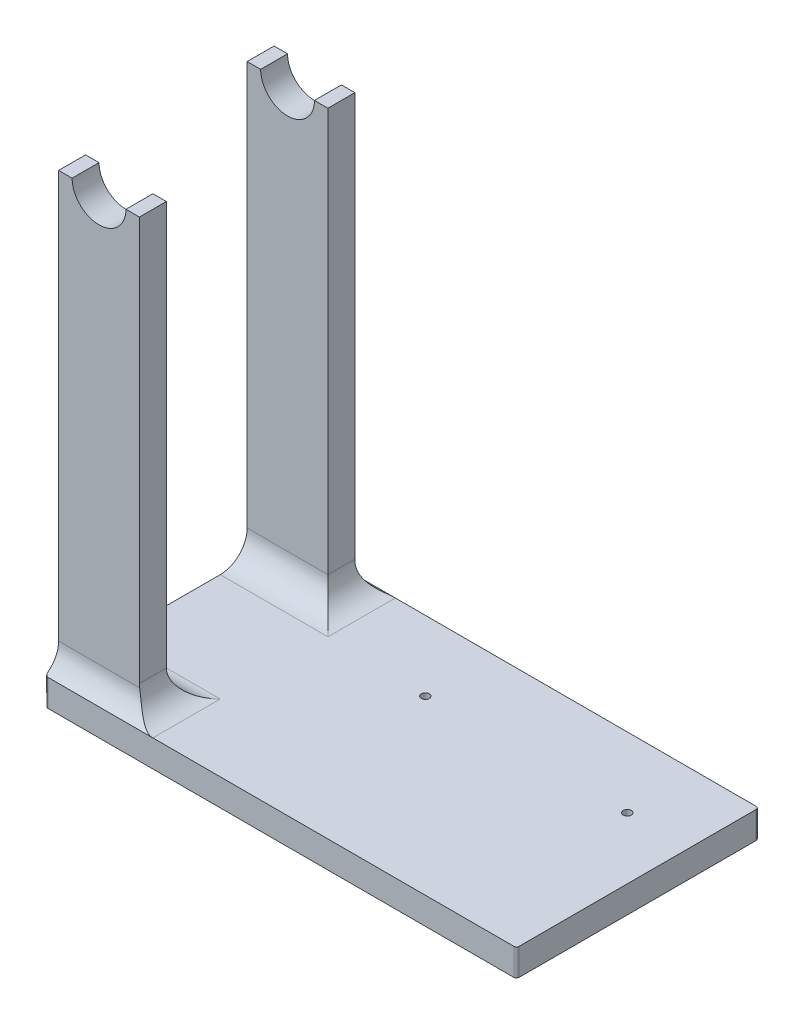
ISO-10303-21;
HEADER;
FILE_DESCRIPTION(('STEP AP214'),'2;1');
FILE_NAME('part.step','',(''),(''),'','','');
FILE_SCHEMA(('AUTOMOTIVE_DESIGN { 1 0 10303 214 1 1 1 1 }'));
ENDSEC;
DATA;
#1=APPLICATION_CONTEXT('core data for automotive mechanical design processes');
#2=APPLICATION_PROTOCOL_DEFINITION('international standard','automotive_design',2000,#1);
#3=PRODUCT_CONTEXT('',#1,'mechanical');
#4=PRODUCT('Part','Part','',(#3));
#5=PRODUCT_RELATED_PRODUCT_CATEGORY('part','',(#4));
#6=PRODUCT_DEFINITION_FORMATION('','',#4);
#7=PRODUCT_DEFINITION_CONTEXT('part definition',#1,'design');
#8=PRODUCT_DEFINITION('design','',#6,#7);
#9=PRODUCT_DEFINITION_SHAPE('','',#8);
#10=(LENGTH_UNIT() NAMED_UNIT(*) SI_UNIT(.MILLI.,.METRE.));
#11=(NAMED_UNIT(*) PLANE_ANGLE_UNIT() SI_UNIT($,.RADIAN.));
#12=(NAMED_UNIT(*) SI_UNIT($,.STERADIAN.) SOLID_ANGLE_UNIT());
#13=UNCERTAINTY_MEASURE_WITH_UNIT(LENGTH_MEASURE(1.E-05),#10,'distance_accuracy_value','');
#14=(GEOMETRIC_REPRESENTATION_CONTEXT(3) GLOBAL_UNCERTAINTY_ASSIGNED_CONTEXT((#13)) GLOBAL_UNIT_ASSIGNED_CONTEXT((#10,
#11,#12)) REPRESENTATION_CONTEXT('',''));
#15=CARTESIAN_POINT('',(0.,0.,0.));
#16=DIRECTION('',(0.,0.,1.));
#17=DIRECTION('',(1.,0.,0.));
#18=AXIS2_PLACEMENT_3D('',#15,#16,#17);
#19=CARTESIAN_POINT('',(0.,10.,0.));
#20=DIRECTION('',(0.,1.,0.));
#21=DIRECTION('',(0.,0.,1.));
#22=AXIS2_PLACEMENT_3D('',#19,#20,#21);
#23=PLANE('',#22);
#24=CARTESIAN_POINT('',(64.65,10.,-19.));
#25=DIRECTION('',(0.,1.,0.));
#26=DIRECTION('',(0.,0.,1.));
#27=AXIS2_PLACEMENT_3D('',#24,#25,#26);
#28=CIRCLE('',#27,1.5);
#29=CARTESIAN_POINT('',(64.65,10.,-17.5));
#30=VERTEX_POINT('',#29);
#31=EDGE_CURVE('E902',#30,#30,#28,.T.);
#32=ORIENTED_EDGE('',*,*,#31,.F.);
#33=EDGE_LOOP('',(#32));
#34=FACE_BOUND('',#33,.T.);
#35=CARTESIAN_POINT('',(-10.35,10.,-19.));
#36=DIRECTION('',(0.,1.,0.));
#37=DIRECTION('',(0.,0.,1.));
#38=AXIS2_PLACEMENT_3D('',#35,#36,#37);
#39=CIRCLE('',#38,1.5);
#40=CARTESIAN_POINT('',(-10.35,10.,-17.5));
#41=VERTEX_POINT('',#40);
#42=EDGE_CURVE('E904',#41,#41,#39,.T.);
#43=ORIENTED_EDGE('',*,*,#42,.F.);
#44=EDGE_LOOP('',(#43));
#45=FACE_BOUND('',#44,.T.);
#46=DIRECTION('',(-1.,0.,0.));
#47=VECTOR('',#46,1.);
#48=CARTESIAN_POINT('',(87.5,10.,-45.));
#49=LINE('',#48,#47);
#50=CARTESIAN_POINT('',(86.5,10.,-45.));
#51=VERTEX_POINT('',#50);
#52=CARTESIAN_POINT('',(-47.5,10.,-45.));
#53=VERTEX_POINT('',#52);
#54=EDGE_CURVE('E377',#51,#53,#49,.T.);
#55=ORIENTED_EDGE('',*,*,#54,.T.);
#56=DIRECTION('',(0.,0.,1.));
#57=VECTOR('',#56,1.);
#58=CARTESIAN_POINT('',(-47.5,10.,0.));
#59=LINE('',#58,#57);
#60=CARTESIAN_POINT('',(-47.5,10.,-20.));
#61=VERTEX_POINT('',#60);
#62=EDGE_CURVE('E449',#53,#61,#59,.T.);
#63=ORIENTED_EDGE('',*,*,#62,.T.);
#64=DIRECTION('',(1.,0.,0.));
#65=VECTOR('',#64,1.);
#66=CARTESIAN_POINT('',(-87.5,10.,-20.));
#67=LINE('',#66,#65);
#68=CARTESIAN_POINT('',(-87.5,10.,-20.));
#69=VERTEX_POINT('',#68);
#70=EDGE_CURVE('E446',#61,#69,#67,.F.);
#71=ORIENTED_EDGE('',*,*,#70,.T.);
#72=DIRECTION('',(0.,0.,1.));
#73=VECTOR('',#72,1.);
#74=CARTESIAN_POINT('',(-87.5,10.,45.));
#75=LINE('',#74,#73);
#76=CARTESIAN_POINT('',(-87.5,10.,20.));
#77=VERTEX_POINT('',#76);
#78=EDGE_CURVE('E362',#69,#77,#75,.T.);
#79=ORIENTED_EDGE('',*,*,#78,.T.);
#80=DIRECTION('',(1.,0.,0.));
#81=VECTOR('',#80,1.);
#82=CARTESIAN_POINT('',(-57.5,10.,20.));
#83=LINE('',#82,#81);
#84=CARTESIAN_POINT('',(-47.5,10.,20.));
#85=VERTEX_POINT('',#84);
#86=EDGE_CURVE('E442',#77,#85,#83,.T.);
#87=ORIENTED_EDGE('',*,*,#86,.T.);
#88=DIRECTION('',(0.,0.,-1.));
#89=VECTOR('',#88,1.);
#90=CARTESIAN_POINT('',(-47.5,10.,0.));
#91=LINE('',#90,#89);
#92=CARTESIAN_POINT('',(-47.5,10.,45.));
#93=VERTEX_POINT('',#92);
#94=EDGE_CURVE('E439',#85,#93,#91,.F.);
#95=ORIENTED_EDGE('',*,*,#94,.T.);
#96=DIRECTION('',(1.,0.,0.));
#97=VECTOR('',#96,1.);
#98=CARTESIAN_POINT('',(87.5,10.,45.));
#99=LINE('',#98,#97);
#100=CARTESIAN_POINT('',(86.5,10.,45.));
#101=VERTEX_POINT('',#100);
#102=EDGE_CURVE('E366',#93,#101,#99,.T.);
#103=ORIENTED_EDGE('',*,*,#102,.T.);
#104=CARTESIAN_POINT('',(86.5,10.,44.));
#105=DIRECTION('',(0.,1.,0.));
#106=DIRECTION('',(0.,0.,1.));
#107=AXIS2_PLACEMENT_3D('',#104,#105,#106);
#108=CIRCLE('',#107,1.);
#109=CARTESIAN_POINT('',(87.5,10.,44.));
#110=VERTEX_POINT('',#109);
#111=EDGE_CURVE('E418',#101,#110,#108,.T.);
#112=ORIENTED_EDGE('',*,*,#111,.T.);
#113=DIRECTION('',(0.,0.,-1.));
#114=VECTOR('',#113,1.);
#115=CARTESIAN_POINT('',(87.5,10.,45.));
#116=LINE('',#115,#114);
#117=CARTESIAN_POINT('',(87.5,10.,-44.));
#118=VERTEX_POINT('',#117);
#119=EDGE_CURVE('E372',#110,#118,#116,.T.);
#120=ORIENTED_EDGE('',*,*,#119,.T.);
#121=CARTESIAN_POINT('',(86.5,10.,-44.));
#122=DIRECTION('',(0.,1.,0.));
#123=DIRECTION('',(0.,0.,1.));
#124=AXIS2_PLACEMENT_3D('',#121,#122,#123);
#125=CIRCLE('',#124,1.);
#126=EDGE_CURVE('E421',#118,#51,#125,.T.);
#127=ORIENTED_EDGE('',*,*,#126,.T.);
#128=EDGE_LOOP('',(#55,#63,#71,#79,#87,#95,#103,#112,#120,#127));
#129=FACE_BOUND('',#128,.T.);
#130=ADVANCED_FACE('F70',(#34,#45,#129),#23,.T.);
#131=CARTESIAN_POINT('',(-87.5,10.,45.));
#132=DIRECTION('',(1.,0.,0.));
#133=DIRECTION('',(0.,0.,-1.));
#134=AXIS2_PLACEMENT_3D('',#131,#132,#133);
#135=PLANE('',#134);
#136=DIRECTION('',(0.,-1.,0.));
#137=VECTOR('',#136,1.);
#138=CARTESIAN_POINT('',(-87.5,160.,-40.));
#139=LINE('',#138,#137);
#140=CARTESIAN_POINT('',(-87.5,170.,-40.));
#141=VERTEX_POINT('',#140);
#142=CARTESIAN_POINT('',(-87.5,18.6602540378444,-40.));
#143=VERTEX_POINT('',#142);
#144=EDGE_CURVE('E292',#141,#143,#139,.T.);
#145=ORIENTED_EDGE('',*,*,#144,.T.);
#146=CARTESIAN_POINT('',(-87.5,18.6602540378444,-50.));
#147=DIRECTION('',(1.,0.,0.));
#148=DIRECTION('',(0.,0.,-1.));
#149=AXIS2_PLACEMENT_3D('',#146,#147,#148);
#150=CIRCLE('',#149,10.);
#151=CARTESIAN_POINT('',(-87.5,10.6602540378444,-44.));
#152=VERTEX_POINT('',#151);
#153=EDGE_CURVE('E469',#143,#152,#150,.T.);
#154=ORIENTED_EDGE('',*,*,#153,.T.);
#155=DIRECTION('',(0.,-1.,0.));
#156=VECTOR('',#155,1.);
#157=CARTESIAN_POINT('',(-87.5,10.,-44.));
#158=LINE('',#157,#156);
#159=CARTESIAN_POINT('',(-87.5,0.,-44.));
#160=VERTEX_POINT('',#159);
#161=EDGE_CURVE('E100',#152,#160,#158,.T.);
#162=ORIENTED_EDGE('',*,*,#161,.T.);
#163=DIRECTION('',(0.,0.,1.));
#164=VECTOR('',#163,1.);
#165=CARTESIAN_POINT('',(-87.5,0.,45.));
#166=LINE('',#165,#164);
#167=CARTESIAN_POINT('',(-87.5,0.,44.));
#168=VERTEX_POINT('',#167);
#169=EDGE_CURVE('E361',#160,#168,#166,.T.);
#170=ORIENTED_EDGE('',*,*,#169,.T.);
#171=DIRECTION('',(0.,-1.,0.));
#172=VECTOR('',#171,1.);
#173=CARTESIAN_POINT('',(-87.5,10.,44.));
#174=LINE('',#173,#172);
#175=CARTESIAN_POINT('',(-87.5,10.6602540378444,44.));
#176=VERTEX_POINT('',#175);
#177=EDGE_CURVE('E92',#168,#176,#174,.F.);
#178=ORIENTED_EDGE('',*,*,#177,.T.);
#179=CARTESIAN_POINT('',(-87.5,18.6602540378444,50.));
#180=DIRECTION('',(1.,0.,0.));
#181=DIRECTION('',(0.,0.,-1.));
#182=AXIS2_PLACEMENT_3D('',#179,#180,#181);
#183=CIRCLE('',#182,10.);
#184=CARTESIAN_POINT('',(-87.5,18.6602540378444,40.));
#185=VERTEX_POINT('',#184);
#186=EDGE_CURVE('E12',#176,#185,#183,.T.);
#187=ORIENTED_EDGE('',*,*,#186,.T.);
#188=DIRECTION('',(0.,-1.,0.));
#189=VECTOR('',#188,1.);
#190=CARTESIAN_POINT('',(-87.5,160.,40.));
#191=LINE('',#190,#189);
#192=CARTESIAN_POINT('',(-87.5,170.,40.));
#193=VERTEX_POINT('',#192);
#194=EDGE_CURVE('E337',#193,#185,#191,.T.);
#195=ORIENTED_EDGE('',*,*,#194,.F.);
#196=DIRECTION('',(0.,0.,1.));
#197=VECTOR('',#196,1.);
#198=CARTESIAN_POINT('',(-87.5,170.,11.97224362268));
#199=LINE('',#198,#197);
#200=CARTESIAN_POINT('',(-87.5,170.,30.));
#201=VERTEX_POINT('',#200);
#202=EDGE_CURVE('E330',#201,#193,#199,.T.);
#203=ORIENTED_EDGE('',*,*,#202,.F.);
#204=DIRECTION('',(0.,-1.,0.));
#205=VECTOR('',#204,1.);
#206=CARTESIAN_POINT('',(-87.5,160.,30.));
#207=LINE('',#206,#205);
#208=CARTESIAN_POINT('',(-87.5,20.,30.));
#209=VERTEX_POINT('',#208);
#210=EDGE_CURVE('E349',#201,#209,#207,.T.);
#211=ORIENTED_EDGE('',*,*,#210,.T.);
#212=CARTESIAN_POINT('',(-87.5,20.,20.));
#213=DIRECTION('',(1.,0.,0.));
#214=DIRECTION('',(0.,0.,-1.));
#215=AXIS2_PLACEMENT_3D('',#212,#213,#214);
#216=CIRCLE('',#215,10.);
#217=EDGE_CURVE('E591',#209,#77,#216,.T.);
#218=ORIENTED_EDGE('',*,*,#217,.T.);
#219=ORIENTED_EDGE('',*,*,#78,.F.);
#220=CARTESIAN_POINT('',(-87.5,20.,-20.));
#221=DIRECTION('',(1.,0.,0.));
#222=DIRECTION('',(0.,0.,-1.));
#223=AXIS2_PLACEMENT_3D('',#220,#221,#222);
#224=CIRCLE('',#223,10.);
#225=CARTESIAN_POINT('',(-87.5,20.,-30.));
#226=VERTEX_POINT('',#225);
#227=EDGE_CURVE('E589',#69,#226,#224,.T.);
#228=ORIENTED_EDGE('',*,*,#227,.T.);
#229=DIRECTION('',(0.,-1.,0.));
#230=VECTOR('',#229,1.);
#231=CARTESIAN_POINT('',(-87.5,160.,-30.));
#232=LINE('',#231,#230);
#233=CARTESIAN_POINT('',(-87.5,170.,-30.));
#234=VERTEX_POINT('',#233);
#235=EDGE_CURVE('E261',#234,#226,#232,.T.);
#236=ORIENTED_EDGE('',*,*,#235,.F.);
#237=DIRECTION('',(0.,0.,-1.));
#238=VECTOR('',#237,1.);
#239=CARTESIAN_POINT('',(-87.5,170.,-11.97224362268));
#240=LINE('',#239,#238);
#241=EDGE_CURVE('E284',#234,#141,#240,.T.);
#242=ORIENTED_EDGE('',*,*,#241,.T.);
#243=EDGE_LOOP('',(#145,#154,#162,#170,#178,#187,#195,#203,#211,#218,#219,#228,#236,#242));
#244=FACE_BOUND('',#243,.T.);
#245=ADVANCED_FACE('F494',(#244),#135,.F.);
#246=CARTESIAN_POINT('',(87.5,10.,45.));
#247=DIRECTION('',(0.,0.,-1.));
#248=DIRECTION('',(-1.,0.,0.));
#249=AXIS2_PLACEMENT_3D('',#246,#247,#248);
#250=PLANE('',#249);
#251=DIRECTION('',(1.,0.,0.));
#252=VECTOR('',#251,1.);
#253=CARTESIAN_POINT('',(87.5,0.,45.));
#254=LINE('',#253,#252);
#255=CARTESIAN_POINT('',(-86.5,0.,45.));
#256=VERTEX_POINT('',#255);
#257=CARTESIAN_POINT('',(86.5,0.,45.));
#258=VERTEX_POINT('',#257);
#259=EDGE_CURVE('E383',#256,#258,#254,.T.);
#260=ORIENTED_EDGE('',*,*,#259,.T.);
#261=DIRECTION('',(0.,-1.,0.));
#262=VECTOR('',#261,1.);
#263=CARTESIAN_POINT('',(86.5,10.,45.));
#264=LINE('',#263,#262);
#265=EDGE_CURVE('E435',#258,#101,#264,.F.);
#266=ORIENTED_EDGE('',*,*,#265,.T.);
#267=ORIENTED_EDGE('',*,*,#102,.F.);
#268=CARTESIAN_POINT('',(-86.5,10.,45.));
#269=VERTEX_POINT('',#268);
#270=EDGE_CURVE('E368',#269,#93,#99,.T.);
#271=ORIENTED_EDGE('',*,*,#270,.F.);
#272=DIRECTION('',(0.,-1.,0.));
#273=VECTOR('',#272,1.);
#274=CARTESIAN_POINT('',(-86.5,10.,45.));
#275=LINE('',#274,#273);
#276=EDGE_CURVE('E431',#269,#256,#275,.T.);
#277=ORIENTED_EDGE('',*,*,#276,.T.);
#278=EDGE_LOOP('',(#260,#266,#267,#271,#277));
#279=FACE_BOUND('',#278,.T.);
#280=ADVANCED_FACE('F542',(#279),#250,.F.);
#281=CARTESIAN_POINT('',(87.5,10.,45.));
#282=DIRECTION('',(-1.,0.,0.));
#283=DIRECTION('',(0.,0.,1.));
#284=AXIS2_PLACEMENT_3D('',#281,#282,#283);
#285=PLANE('',#284);
#286=DIRECTION('',(0.,0.,-1.));
#287=VECTOR('',#286,1.);
#288=CARTESIAN_POINT('',(87.5,0.,45.));
#289=LINE('',#288,#287);
#290=CARTESIAN_POINT('',(87.5,0.,44.));
#291=VERTEX_POINT('',#290);
#292=CARTESIAN_POINT('',(87.5,0.,-44.));
#293=VERTEX_POINT('',#292);
#294=EDGE_CURVE('E387',#291,#293,#289,.T.);
#295=ORIENTED_EDGE('',*,*,#294,.T.);
#296=DIRECTION('',(0.,-1.,0.));
#297=VECTOR('',#296,1.);
#298=CARTESIAN_POINT('',(87.5,10.,-44.));
#299=LINE('',#298,#297);
#300=EDGE_CURVE('E428',#293,#118,#299,.F.);
#301=ORIENTED_EDGE('',*,*,#300,.T.);
#302=ORIENTED_EDGE('',*,*,#119,.F.);
#303=DIRECTION('',(0.,-1.,0.));
#304=VECTOR('',#303,1.);
#305=CARTESIAN_POINT('',(87.5,10.,44.));
#306=LINE('',#305,#304);
#307=EDGE_CURVE('E424',#110,#291,#306,.T.);
#308=ORIENTED_EDGE('',*,*,#307,.T.);
#309=EDGE_LOOP('',(#295,#301,#302,#308));
#310=FACE_BOUND('',#309,.T.);
#311=ADVANCED_FACE('F556',(#310),#285,.F.);
#312=CARTESIAN_POINT('',(87.5,10.,-45.));
#313=DIRECTION('',(0.,0.,1.));
#314=DIRECTION('',(1.,0.,0.));
#315=AXIS2_PLACEMENT_3D('',#312,#313,#314);
#316=PLANE('',#315);
#317=DIRECTION('',(-1.,0.,0.));
#318=VECTOR('',#317,1.);
#319=CARTESIAN_POINT('',(87.5,0.,-45.));
#320=LINE('',#319,#318);
#321=CARTESIAN_POINT('',(86.5,0.,-45.));
#322=VERTEX_POINT('',#321);
#323=CARTESIAN_POINT('',(-86.5,0.,-45.));
#324=VERTEX_POINT('',#323);
#325=EDGE_CURVE('E367',#322,#324,#320,.T.);
#326=ORIENTED_EDGE('',*,*,#325,.T.);
#327=DIRECTION('',(0.,-1.,0.));
#328=VECTOR('',#327,1.);
#329=CARTESIAN_POINT('',(-86.5,10.,-45.));
#330=LINE('',#329,#328);
#331=CARTESIAN_POINT('',(-86.5,10.,-45.));
#332=VERTEX_POINT('',#331);
#333=EDGE_CURVE('E414',#324,#332,#330,.F.);
#334=ORIENTED_EDGE('',*,*,#333,.T.);
#335=EDGE_CURVE('E376',#53,#332,#49,.T.);
#336=ORIENTED_EDGE('',*,*,#335,.F.);
#337=ORIENTED_EDGE('',*,*,#54,.F.);
#338=DIRECTION('',(0.,-1.,0.));
#339=VECTOR('',#338,1.);
#340=CARTESIAN_POINT('',(86.5,10.,-45.));
#341=LINE('',#340,#339);
#342=EDGE_CURVE('E410',#51,#322,#341,.T.);
#343=ORIENTED_EDGE('',*,*,#342,.T.);
#344=EDGE_LOOP('',(#326,#334,#336,#337,#343));
#345=FACE_BOUND('',#344,.T.);
#346=ADVANCED_FACE('F552',(#345),#316,.F.);
#347=CARTESIAN_POINT('',(0.,0.,0.));
#348=DIRECTION('',(0.,1.,0.));
#349=DIRECTION('',(0.,0.,1.));
#350=AXIS2_PLACEMENT_3D('',#347,#348,#349);
#351=PLANE('',#350);
#352=CARTESIAN_POINT('',(64.65,0.,-19.));
#353=DIRECTION('',(0.,1.,0.));
#354=DIRECTION('',(0.,0.,1.));
#355=AXIS2_PLACEMENT_3D('',#352,#353,#354);
#356=CIRCLE('',#355,1.5);
#357=CARTESIAN_POINT('',(64.65,0.,-17.5));
#358=VERTEX_POINT('',#357);
#359=EDGE_CURVE('E270',#358,#358,#356,.T.);
#360=ORIENTED_EDGE('',*,*,#359,.T.);
#361=EDGE_LOOP('',(#360));
#362=FACE_BOUND('',#361,.T.);
#363=CARTESIAN_POINT('',(-10.35,0.,-19.));
#364=DIRECTION('',(0.,1.,0.));
#365=DIRECTION('',(0.,0.,1.));
#366=AXIS2_PLACEMENT_3D('',#363,#364,#365);
#367=CIRCLE('',#366,1.5);
#368=CARTESIAN_POINT('',(-10.35,0.,-17.5));
#369=VERTEX_POINT('',#368);
#370=EDGE_CURVE('E274',#369,#369,#367,.T.);
#371=ORIENTED_EDGE('',*,*,#370,.T.);
#372=EDGE_LOOP('',(#371));
#373=FACE_BOUND('',#372,.T.);
#374=ORIENTED_EDGE('',*,*,#169,.F.);
#375=CARTESIAN_POINT('',(-86.5,0.,-44.));
#376=DIRECTION('',(0.,1.,0.));
#377=DIRECTION('',(0.,0.,1.));
#378=AXIS2_PLACEMENT_3D('',#375,#376,#377);
#379=CIRCLE('',#378,1.);
#380=EDGE_CURVE('E407',#160,#324,#379,.F.);
#381=ORIENTED_EDGE('',*,*,#380,.T.);
#382=ORIENTED_EDGE('',*,*,#325,.F.);
#383=CARTESIAN_POINT('',(86.5,0.,-44.));
#384=DIRECTION('',(0.,1.,0.));
#385=DIRECTION('',(0.,0.,1.));
#386=AXIS2_PLACEMENT_3D('',#383,#384,#385);
#387=CIRCLE('',#386,1.);
#388=EDGE_CURVE('E404',#322,#293,#387,.F.);
#389=ORIENTED_EDGE('',*,*,#388,.T.);
#390=ORIENTED_EDGE('',*,*,#294,.F.);
#391=CARTESIAN_POINT('',(86.5,0.,44.));
#392=DIRECTION('',(0.,1.,0.));
#393=DIRECTION('',(0.,0.,1.));
#394=AXIS2_PLACEMENT_3D('',#391,#392,#393);
#395=CIRCLE('',#394,1.);
#396=EDGE_CURVE('E401',#291,#258,#395,.F.);
#397=ORIENTED_EDGE('',*,*,#396,.T.);
#398=ORIENTED_EDGE('',*,*,#259,.F.);
#399=CARTESIAN_POINT('',(-86.5,0.,44.));
#400=DIRECTION('',(0.,1.,0.));
#401=DIRECTION('',(0.,0.,1.));
#402=AXIS2_PLACEMENT_3D('',#399,#400,#401);
#403=CIRCLE('',#402,1.);
#404=EDGE_CURVE('E398',#256,#168,#403,.F.);
#405=ORIENTED_EDGE('',*,*,#404,.T.);
#406=EDGE_LOOP('',(#374,#381,#382,#389,#390,#397,#398,#405));
#407=FACE_BOUND('',#406,.T.);
#408=ADVANCED_FACE('F549',(#362,#373,#407),#351,.F.);
#409=CARTESIAN_POINT('',(0.,160.,40.));
#410=DIRECTION('',(0.,0.,-1.));
#411=DIRECTION('',(-1.,0.,0.));
#412=AXIS2_PLACEMENT_3D('',#409,#410,#411);
#413=PLANE('',#412);
#414=ORIENTED_EDGE('',*,*,#194,.T.);
#415=DIRECTION('',(-1.,0.,0.));
#416=VECTOR('',#415,1.);
#417=CARTESIAN_POINT('',(0.,18.6602540378444,40.));
#418=LINE('',#417,#416);
#419=CARTESIAN_POINT('',(-57.4098476656752,18.6602540378444,40.));
#420=VERTEX_POINT('',#419);
#421=EDGE_CURVE('E466',#185,#420,#418,.F.);
#422=ORIENTED_EDGE('',*,*,#421,.T.);
#423=CARTESIAN_POINT('',(-47.5,20.,40.));
#424=DIRECTION('',(0.,0.,-1.));
#425=DIRECTION('',(-1.,0.,0.));
#426=AXIS2_PLACEMENT_3D('',#423,#424,#425);
#427=CIRCLE('',#426,10.);
#428=CARTESIAN_POINT('',(-57.5,20.,40.));
#429=VERTEX_POINT('',#428);
#430=EDGE_CURVE('E517',#420,#429,#427,.T.);
#431=ORIENTED_EDGE('',*,*,#430,.T.);
#432=DIRECTION('',(0.,-1.,0.));
#433=VECTOR('',#432,1.);
#434=CARTESIAN_POINT('',(-57.5,160.,40.));
#435=LINE('',#434,#433);
#436=CARTESIAN_POINT('',(-57.5,170.,40.));
#437=VERTEX_POINT('',#436);
#438=EDGE_CURVE('E357',#437,#429,#435,.T.);
#439=ORIENTED_EDGE('',*,*,#438,.F.);
#440=DIRECTION('',(-1.,0.,0.));
#441=VECTOR('',#440,1.);
#442=CARTESIAN_POINT('',(9.43689570931383E-13,170.,40.));
#443=LINE('',#442,#441);
#444=CARTESIAN_POINT('',(-62.5,170.,40.));
#445=VERTEX_POINT('',#444);
#446=EDGE_CURVE('E308',#437,#445,#443,.T.);
#447=ORIENTED_EDGE('',*,*,#446,.T.);
#448=CARTESIAN_POINT('',(-72.5,170.,40.));
#449=DIRECTION('',(0.,0.,1.));
#450=DIRECTION('',(1.,0.,0.));
#451=AXIS2_PLACEMENT_3D('',#448,#449,#450);
#452=CIRCLE('',#451,10.);
#453=CARTESIAN_POINT('',(-82.5,170.,40.));
#454=VERTEX_POINT('',#453);
#455=EDGE_CURVE('E331',#454,#445,#452,.T.);
#456=ORIENTED_EDGE('',*,*,#455,.F.);
#457=DIRECTION('',(1.,0.,0.));
#458=VECTOR('',#457,1.);
#459=CARTESIAN_POINT('',(-9.43689570931388E-13,170.000000000001,40.));
#460=LINE('',#459,#458);
#461=EDGE_CURVE('E325',#193,#454,#460,.T.);
#462=ORIENTED_EDGE('',*,*,#461,.F.);
#463=EDGE_LOOP('',(#414,#422,#431,#439,#447,#456,#462));
#464=FACE_BOUND('',#463,.T.);
#465=ADVANCED_FACE('F547',(#464),#413,.F.);
#466=CARTESIAN_POINT('',(-57.5,160.,0.));
#467=DIRECTION('',(-1.,0.,0.));
#468=DIRECTION('',(0.,0.,1.));
#469=AXIS2_PLACEMENT_3D('',#466,#467,#468);
#470=PLANE('',#469);
#471=ORIENTED_EDGE('',*,*,#438,.T.);
#472=DIRECTION('',(0.,0.,-1.));
#473=VECTOR('',#472,1.);
#474=CARTESIAN_POINT('',(-57.5,20.,0.));
#475=LINE('',#474,#473);
#476=CARTESIAN_POINT('',(-57.5,20.,30.));
#477=VERTEX_POINT('',#476);
#478=EDGE_CURVE('E463',#429,#477,#475,.T.);
#479=ORIENTED_EDGE('',*,*,#478,.T.);
#480=DIRECTION('',(0.,-1.,0.));
#481=VECTOR('',#480,1.);
#482=CARTESIAN_POINT('',(-57.5,160.,30.));
#483=LINE('',#482,#481);
#484=CARTESIAN_POINT('',(-57.5,170.,30.));
#485=VERTEX_POINT('',#484);
#486=EDGE_CURVE('E353',#485,#477,#483,.T.);
#487=ORIENTED_EDGE('',*,*,#486,.F.);
#488=DIRECTION('',(0.,0.,1.));
#489=VECTOR('',#488,1.);
#490=CARTESIAN_POINT('',(-57.5,170.,11.97224362268));
#491=LINE('',#490,#489);
#492=EDGE_CURVE('E309',#485,#437,#491,.T.);
#493=ORIENTED_EDGE('',*,*,#492,.T.);
#494=EDGE_LOOP('',(#471,#479,#487,#493));
#495=FACE_BOUND('',#494,.T.);
#496=ADVANCED_FACE('F601',(#495),#470,.F.);
#497=CARTESIAN_POINT('',(0.,160.,30.));
#498=DIRECTION('',(0.,0.,-1.));
#499=DIRECTION('',(-1.,0.,0.));
#500=AXIS2_PLACEMENT_3D('',#497,#498,#499);
#501=PLANE('',#500);
#502=ORIENTED_EDGE('',*,*,#486,.T.);
#503=DIRECTION('',(1.,0.,0.));
#504=VECTOR('',#503,1.);
#505=CARTESIAN_POINT('',(-87.5,20.,30.));
#506=LINE('',#505,#504);
#507=EDGE_CURVE('E460',#477,#209,#506,.F.);
#508=ORIENTED_EDGE('',*,*,#507,.T.);
#509=ORIENTED_EDGE('',*,*,#210,.F.);
#510=DIRECTION('',(1.,0.,0.));
#511=VECTOR('',#510,1.);
#512=CARTESIAN_POINT('',(-9.43689570931388E-13,170.000000000001,30.));
#513=LINE('',#512,#511);
#514=CARTESIAN_POINT('',(-82.5,170.,30.));
#515=VERTEX_POINT('',#514);
#516=EDGE_CURVE('E329',#201,#515,#513,.T.);
#517=ORIENTED_EDGE('',*,*,#516,.T.);
#518=CARTESIAN_POINT('',(-72.5,170.,30.));
#519=DIRECTION('',(0.,0.,-1.));
#520=DIRECTION('',(-1.,0.,0.));
#521=AXIS2_PLACEMENT_3D('',#518,#519,#520);
#522=CIRCLE('',#521,10.);
#523=CARTESIAN_POINT('',(-62.5,170.,30.));
#524=VERTEX_POINT('',#523);
#525=EDGE_CURVE('E334',#515,#524,#522,.F.);
#526=ORIENTED_EDGE('',*,*,#525,.T.);
#527=DIRECTION('',(-1.,0.,0.));
#528=VECTOR('',#527,1.);
#529=CARTESIAN_POINT('',(9.43689570931383E-13,170.,30.));
#530=LINE('',#529,#528);
#531=EDGE_CURVE('E313',#485,#524,#530,.T.);
#532=ORIENTED_EDGE('',*,*,#531,.F.);
#533=EDGE_LOOP('',(#502,#508,#509,#517,#526,#532));
#534=FACE_BOUND('',#533,.T.);
#535=ADVANCED_FACE('F646',(#534),#501,.T.);
#536=CARTESIAN_POINT('',(-72.5,170.,11.97224362268));
#537=DIRECTION('',(0.,0.,1.));
#538=DIRECTION('',(1.,0.,0.));
#539=AXIS2_PLACEMENT_3D('',#536,#537,#538);
#540=CYLINDRICAL_SURFACE('',#539,10.);
#541=ORIENTED_EDGE('',*,*,#525,.F.);
#542=DIRECTION('',(0.,0.,1.));
#543=VECTOR('',#542,1.);
#544=CARTESIAN_POINT('',(-82.5,170.,11.97224362268));
#545=LINE('',#544,#543);
#546=EDGE_CURVE('E318',#515,#454,#545,.T.);
#547=ORIENTED_EDGE('',*,*,#546,.T.);
#548=ORIENTED_EDGE('',*,*,#455,.T.);
#549=DIRECTION('',(0.,0.,1.));
#550=VECTOR('',#549,1.);
#551=CARTESIAN_POINT('',(-62.5,170.,11.97224362268));
#552=LINE('',#551,#550);
#553=EDGE_CURVE('E314',#524,#445,#552,.T.);
#554=ORIENTED_EDGE('',*,*,#553,.F.);
#555=EDGE_LOOP('',(#541,#547,#548,#554));
#556=FACE_BOUND('',#555,.T.);
#557=ADVANCED_FACE('F652',(#556),#540,.F.);
#558=CARTESIAN_POINT('',(-9.43689570931388E-13,170.000000000001,11.97224362268));
#559=DIRECTION('',(0.,-1.,0.));
#560=DIRECTION('',(1.,0.,0.));
#561=AXIS2_PLACEMENT_3D('',#558,#559,#560);
#562=PLANE('',#561);
#563=ORIENTED_EDGE('',*,*,#516,.F.);
#564=ORIENTED_EDGE('',*,*,#202,.T.);
#565=ORIENTED_EDGE('',*,*,#461,.T.);
#566=ORIENTED_EDGE('',*,*,#546,.F.);
#567=EDGE_LOOP('',(#563,#564,#565,#566));
#568=FACE_BOUND('',#567,.T.);
#569=ADVANCED_FACE('F642',(#568),#562,.F.);
#570=CARTESIAN_POINT('',(9.43689570931383E-13,170.,11.97224362268));
#571=DIRECTION('',(0.,1.,0.));
#572=DIRECTION('',(-1.,0.,0.));
#573=AXIS2_PLACEMENT_3D('',#570,#571,#572);
#574=PLANE('',#573);
#575=ORIENTED_EDGE('',*,*,#492,.F.);
#576=ORIENTED_EDGE('',*,*,#531,.T.);
#577=ORIENTED_EDGE('',*,*,#553,.T.);
#578=ORIENTED_EDGE('',*,*,#446,.F.);
#579=EDGE_LOOP('',(#575,#576,#577,#578));
#580=FACE_BOUND('',#579,.T.);
#581=ADVANCED_FACE('F650',(#580),#574,.T.);
#582=CARTESIAN_POINT('',(0.,160.,-40.));
#583=DIRECTION('',(0.,0.,1.));
#584=DIRECTION('',(-1.,0.,0.));
#585=AXIS2_PLACEMENT_3D('',#582,#583,#584);
#586=PLANE('',#585);
#587=DIRECTION('',(0.,-1.,0.));
#588=VECTOR('',#587,1.);
#589=CARTESIAN_POINT('',(-57.5,160.,-40.));
#590=LINE('',#589,#588);
#591=CARTESIAN_POINT('',(-57.5,170.,-40.));
#592=VERTEX_POINT('',#591);
#593=CARTESIAN_POINT('',(-57.5,20.,-40.));
#594=VERTEX_POINT('',#593);
#595=EDGE_CURVE('E260',#592,#594,#590,.T.);
#596=ORIENTED_EDGE('',*,*,#595,.T.);
#597=CARTESIAN_POINT('',(-47.5,20.,-40.));
#598=DIRECTION('',(0.,0.,1.));
#599=DIRECTION('',(1.,0.,0.));
#600=AXIS2_PLACEMENT_3D('',#597,#598,#599);
#601=CIRCLE('',#600,10.);
#602=CARTESIAN_POINT('',(-57.4098476656752,18.6602540378444,-40.));
#603=VERTEX_POINT('',#602);
#604=EDGE_CURVE('E481',#594,#603,#601,.T.);
#605=ORIENTED_EDGE('',*,*,#604,.T.);
#606=DIRECTION('',(1.,0.,0.));
#607=VECTOR('',#606,1.);
#608=CARTESIAN_POINT('',(0.,18.6602540378444,-40.));
#609=LINE('',#608,#607);
#610=EDGE_CURVE('E452',#603,#143,#609,.F.);
#611=ORIENTED_EDGE('',*,*,#610,.T.);
#612=ORIENTED_EDGE('',*,*,#144,.F.);
#613=DIRECTION('',(1.,0.,0.));
#614=VECTOR('',#613,1.);
#615=CARTESIAN_POINT('',(-9.43689570931388E-13,170.000000000001,-40.));
#616=LINE('',#615,#614);
#617=CARTESIAN_POINT('',(-82.5,170.,-40.));
#618=VERTEX_POINT('',#617);
#619=EDGE_CURVE('E279',#141,#618,#616,.T.);
#620=ORIENTED_EDGE('',*,*,#619,.T.);
#621=CARTESIAN_POINT('',(-72.5,170.,-40.));
#622=DIRECTION('',(0.,0.,1.));
#623=DIRECTION('',(1.,0.,0.));
#624=AXIS2_PLACEMENT_3D('',#621,#622,#623);
#625=CIRCLE('',#624,10.);
#626=CARTESIAN_POINT('',(-62.5,170.,-40.));
#627=VERTEX_POINT('',#626);
#628=EDGE_CURVE('E285',#618,#627,#625,.T.);
#629=ORIENTED_EDGE('',*,*,#628,.T.);
#630=DIRECTION('',(-1.,0.,0.));
#631=VECTOR('',#630,1.);
#632=CARTESIAN_POINT('',(9.43689570931383E-13,170.,-40.));
#633=LINE('',#632,#631);
#634=EDGE_CURVE('E267',#592,#627,#633,.T.);
#635=ORIENTED_EDGE('',*,*,#634,.F.);
#636=EDGE_LOOP('',(#596,#605,#611,#612,#620,#629,#635));
#637=FACE_BOUND('',#636,.T.);
#638=ADVANCED_FACE('F760',(#637),#586,.F.);
#639=CARTESIAN_POINT('',(-57.5,160.,0.));
#640=DIRECTION('',(-1.,0.,0.));
#641=DIRECTION('',(0.,0.,-1.));
#642=AXIS2_PLACEMENT_3D('',#639,#640,#641);
#643=PLANE('',#642);
#644=DIRECTION('',(0.,-1.,0.));
#645=VECTOR('',#644,1.);
#646=CARTESIAN_POINT('',(-57.5,160.,-30.));
#647=LINE('',#646,#645);
#648=CARTESIAN_POINT('',(-57.5,170.,-30.));
#649=VERTEX_POINT('',#648);
#650=CARTESIAN_POINT('',(-57.5,20.,-30.));
#651=VERTEX_POINT('',#650);
#652=EDGE_CURVE('E252',#649,#651,#647,.T.);
#653=ORIENTED_EDGE('',*,*,#652,.T.);
#654=DIRECTION('',(0.,0.,1.));
#655=VECTOR('',#654,1.);
#656=CARTESIAN_POINT('',(-57.5,20.,0.));
#657=LINE('',#656,#655);
#658=EDGE_CURVE('E455',#651,#594,#657,.F.);
#659=ORIENTED_EDGE('',*,*,#658,.T.);
#660=ORIENTED_EDGE('',*,*,#595,.F.);
#661=DIRECTION('',(0.,0.,-1.));
#662=VECTOR('',#661,1.);
#663=CARTESIAN_POINT('',(-57.5,170.,-11.97224362268));
#664=LINE('',#663,#662);
#665=EDGE_CURVE('E243',#649,#592,#664,.T.);
#666=ORIENTED_EDGE('',*,*,#665,.F.);
#667=EDGE_LOOP('',(#653,#659,#660,#666));
#668=FACE_BOUND('',#667,.T.);
#669=ADVANCED_FACE('F263',(#668),#643,.F.);
#670=CARTESIAN_POINT('',(0.,160.,-30.));
#671=DIRECTION('',(0.,0.,1.));
#672=DIRECTION('',(-1.,0.,0.));
#673=AXIS2_PLACEMENT_3D('',#670,#671,#672);
#674=PLANE('',#673);
#675=ORIENTED_EDGE('',*,*,#235,.T.);
#676=DIRECTION('',(1.,0.,0.));
#677=VECTOR('',#676,1.);
#678=CARTESIAN_POINT('',(-57.5,20.,-30.));
#679=LINE('',#678,#677);
#680=EDGE_CURVE('E256',#226,#651,#679,.T.);
#681=ORIENTED_EDGE('',*,*,#680,.T.);
#682=ORIENTED_EDGE('',*,*,#652,.F.);
#683=DIRECTION('',(-1.,0.,0.));
#684=VECTOR('',#683,1.);
#685=CARTESIAN_POINT('',(9.43689570931383E-13,170.,-30.));
#686=LINE('',#685,#684);
#687=CARTESIAN_POINT('',(-62.5,170.,-30.));
#688=VERTEX_POINT('',#687);
#689=EDGE_CURVE('E238',#649,#688,#686,.T.);
#690=ORIENTED_EDGE('',*,*,#689,.T.);
#691=CARTESIAN_POINT('',(-72.5,170.,-30.));
#692=DIRECTION('',(0.,0.,-1.));
#693=DIRECTION('',(-1.,0.,0.));
#694=AXIS2_PLACEMENT_3D('',#691,#692,#693);
#695=CIRCLE('',#694,10.);
#696=CARTESIAN_POINT('',(-82.5,170.,-30.));
#697=VERTEX_POINT('',#696);
#698=EDGE_CURVE('E289',#697,#688,#695,.F.);
#699=ORIENTED_EDGE('',*,*,#698,.F.);
#700=DIRECTION('',(1.,0.,0.));
#701=VECTOR('',#700,1.);
#702=CARTESIAN_POINT('',(-9.43689570931388E-13,170.000000000001,-30.));
#703=LINE('',#702,#701);
#704=EDGE_CURVE('E283',#234,#697,#703,.T.);
#705=ORIENTED_EDGE('',*,*,#704,.F.);
#706=EDGE_LOOP('',(#675,#681,#682,#690,#699,#705));
#707=FACE_BOUND('',#706,.T.);
#708=ADVANCED_FACE('F254',(#707),#674,.T.);
#709=CARTESIAN_POINT('',(-72.5,170.,-11.97224362268));
#710=DIRECTION('',(0.,0.,-1.));
#711=DIRECTION('',(1.,0.,0.));
#712=AXIS2_PLACEMENT_3D('',#709,#710,#711);
#713=CYLINDRICAL_SURFACE('',#712,10.);
#714=ORIENTED_EDGE('',*,*,#698,.T.);
#715=DIRECTION('',(0.,0.,-1.));
#716=VECTOR('',#715,1.);
#717=CARTESIAN_POINT('',(-62.5,170.,-11.97224362268));
#718=LINE('',#717,#716);
#719=EDGE_CURVE('E245',#688,#627,#718,.T.);
#720=ORIENTED_EDGE('',*,*,#719,.T.);
#721=ORIENTED_EDGE('',*,*,#628,.F.);
#722=DIRECTION('',(0.,0.,-1.));
#723=VECTOR('',#722,1.);
#724=CARTESIAN_POINT('',(-82.5,170.,-11.97224362268));
#725=LINE('',#724,#723);
#726=EDGE_CURVE('E277',#697,#618,#725,.T.);
#727=ORIENTED_EDGE('',*,*,#726,.F.);
#728=EDGE_LOOP('',(#714,#720,#721,#727));
#729=FACE_BOUND('',#728,.T.);
#730=ADVANCED_FACE('F751',(#729),#713,.F.);
#731=CARTESIAN_POINT('',(-9.43689570931388E-13,170.000000000001,-11.97224362268));
#732=DIRECTION('',(0.,-1.,0.));
#733=DIRECTION('',(1.,0.,0.));
#734=AXIS2_PLACEMENT_3D('',#731,#732,#733);
#735=PLANE('',#734);
#736=ORIENTED_EDGE('',*,*,#704,.T.);
#737=ORIENTED_EDGE('',*,*,#726,.T.);
#738=ORIENTED_EDGE('',*,*,#619,.F.);
#739=ORIENTED_EDGE('',*,*,#241,.F.);
#740=EDGE_LOOP('',(#736,#737,#738,#739));
#741=FACE_BOUND('',#740,.T.);
#742=ADVANCED_FACE('F631',(#741),#735,.F.);
#743=CARTESIAN_POINT('',(9.43689570931383E-13,170.,-11.97224362268));
#744=DIRECTION('',(0.,1.,0.));
#745=DIRECTION('',(-1.,0.,0.));
#746=AXIS2_PLACEMENT_3D('',#743,#744,#745);
#747=PLANE('',#746);
#748=ORIENTED_EDGE('',*,*,#665,.T.);
#749=ORIENTED_EDGE('',*,*,#634,.T.);
#750=ORIENTED_EDGE('',*,*,#719,.F.);
#751=ORIENTED_EDGE('',*,*,#689,.F.);
#752=EDGE_LOOP('',(#748,#749,#750,#751));
#753=FACE_BOUND('',#752,.T.);
#754=ADVANCED_FACE('F240',(#753),#747,.T.);
#755=CARTESIAN_POINT('',(-10.35,0.,-19.));
#756=DIRECTION('',(0.,1.,0.));
#757=DIRECTION('',(0.,0.,1.));
#758=AXIS2_PLACEMENT_3D('',#755,#756,#757);
#759=CYLINDRICAL_SURFACE('',#758,1.5);
#760=ORIENTED_EDGE('',*,*,#370,.F.);
#761=EDGE_LOOP('',(#760));
#762=FACE_BOUND('',#761,.T.);
#763=ORIENTED_EDGE('',*,*,#42,.T.);
#764=EDGE_LOOP('',(#763));
#765=FACE_BOUND('',#764,.T.);
#766=ADVANCED_FACE('F848',(#762,#765),#759,.F.);
#767=CARTESIAN_POINT('',(64.65,0.,-19.));
#768=DIRECTION('',(0.,1.,0.));
#769=DIRECTION('',(0.,0.,1.));
#770=AXIS2_PLACEMENT_3D('',#767,#768,#769);
#771=CYLINDRICAL_SURFACE('',#770,1.5);
#772=ORIENTED_EDGE('',*,*,#359,.F.);
#773=EDGE_LOOP('',(#772));
#774=FACE_BOUND('',#773,.T.);
#775=ORIENTED_EDGE('',*,*,#31,.T.);
#776=EDGE_LOOP('',(#775));
#777=FACE_BOUND('',#776,.T.);
#778=ADVANCED_FACE('F493',(#774,#777),#771,.F.);
#779=CARTESIAN_POINT('',(-86.5,10.,-44.));
#780=DIRECTION('',(0.,-1.,0.));
#781=DIRECTION('',(0.,0.,-1.));
#782=AXIS2_PLACEMENT_3D('',#779,#780,#781);
#783=CYLINDRICAL_SURFACE('',#782,1.);
#784=ORIENTED_EDGE('',*,*,#161,.F.);
#785=CARTESIAN_POINT('',(-87.5,10.6602540378444,-44.));
#786=CARTESIAN_POINT('',(-87.4999921729148,10.634814111288,-44.0339183412573));
#787=CARTESIAN_POINT('',(-87.4982724755659,10.6096042313898,-44.0679835137245));
#788=CARTESIAN_POINT('',(-87.4912740577208,10.5597582216326,-44.1362335498948));
#789=CARTESIAN_POINT('',(-87.4859907289551,10.5351228774563,-44.1704185114896));
#790=CARTESIAN_POINT('',(-87.4645455862767,10.4621686877461,-44.2730105643661));
#791=CARTESIAN_POINT('',(-87.4427865999441,10.414992138185,-44.3412005799913));
#792=CARTESIAN_POINT('',(-87.3904981921316,10.3359292205058,-44.4583921903274));
#793=CARTESIAN_POINT('',(-87.3631843652851,10.3030381638006,-44.5081688245132));
#794=CARTESIAN_POINT('',(-87.2992037227391,10.2409776912114,-44.6037960529355));
#795=CARTESIAN_POINT('',(-87.2625564801788,10.2118006763297,-44.6496545982766));
#796=CARTESIAN_POINT('',(-87.1797583581888,10.1577990675054,-44.7358879491454));
#797=CARTESIAN_POINT('',(-87.1335306347825,10.133012874384,-44.7762137373241));
#798=CARTESIAN_POINT('',(-87.0326102404554,10.0890706644176,-44.8486294747848));
#799=CARTESIAN_POINT('',(-86.9779191208727,10.0699136176133,-44.8807209305581));
#800=CARTESIAN_POINT('',(-86.8699795998932,10.040356141172,-44.9306719905361));
#801=CARTESIAN_POINT('',(-86.8175889017185,10.0291082880466,-44.9498903820636));
#802=CARTESIAN_POINT('',(-86.7095829557197,10.0119196235216,-44.9793814805044));
#803=CARTESIAN_POINT('',(-86.6539765247817,10.0059649714813,-44.9896775157746));
#804=CARTESIAN_POINT('',(-86.5815909773803,10.0018475293138,-44.9968012960742));
#805=CARTESIAN_POINT('',(-86.5652911205965,10.0011545136021,-44.9980008509675));
#806=CARTESIAN_POINT('',(-86.5326635927851,10.0002314759307,-44.9995989285374));
#807=CARTESIAN_POINT('',(-86.5163360000695,10.0000007615451,-44.9999986491891));
#808=CARTESIAN_POINT('',(-86.5,9.99999999999992,-45.));
#809=B_SPLINE_CURVE_WITH_KNOTS('',3,(#785,#786,#787,#788,#789,#790,#791,#792,#793,#794,#795,
#796,#797,#798,#799,#800,#801,#802,#803,#804,#805,#806,#807,#808),.UNSPECIFIED.,.F.,.F.,(4,2,2,
2,2,2,2,2,2,2,2,4),(0.,0.127113128917846,0.254390948670954,0.50988726177485,0.705977175263336,
0.901659206161642,1.09897614477801,1.29625695799961,1.46609347136824,1.63548457938731,
1.6845428215693,1.7335275301728),.UNSPECIFIED.);
#810=EDGE_CURVE('E472',#152,#332,#809,.T.);
#811=ORIENTED_EDGE('',*,*,#810,.T.);
#812=ORIENTED_EDGE('',*,*,#333,.F.);
#813=ORIENTED_EDGE('',*,*,#380,.F.);
#814=EDGE_LOOP('',(#784,#811,#812,#813));
#815=FACE_BOUND('',#814,.T.);
#816=ADVANCED_FACE('F487',(#815),#783,.T.);
#817=CARTESIAN_POINT('',(86.5,10.,-44.));
#818=DIRECTION('',(0.,-1.,0.));
#819=DIRECTION('',(0.,0.,-1.));
#820=AXIS2_PLACEMENT_3D('',#817,#818,#819);
#821=CYLINDRICAL_SURFACE('',#820,1.);
#822=ORIENTED_EDGE('',*,*,#126,.F.);
#823=ORIENTED_EDGE('',*,*,#300,.F.);
#824=ORIENTED_EDGE('',*,*,#388,.F.);
#825=ORIENTED_EDGE('',*,*,#342,.F.);
#826=EDGE_LOOP('',(#822,#823,#824,#825));
#827=FACE_BOUND('',#826,.T.);
#828=ADVANCED_FACE('F492',(#827),#821,.T.);
#829=CARTESIAN_POINT('',(86.5,10.,44.));
#830=DIRECTION('',(0.,-1.,0.));
#831=DIRECTION('',(0.,0.,-1.));
#832=AXIS2_PLACEMENT_3D('',#829,#830,#831);
#833=CYLINDRICAL_SURFACE('',#832,1.);
#834=ORIENTED_EDGE('',*,*,#111,.F.);
#835=ORIENTED_EDGE('',*,*,#265,.F.);
#836=ORIENTED_EDGE('',*,*,#396,.F.);
#837=ORIENTED_EDGE('',*,*,#307,.F.);
#838=EDGE_LOOP('',(#834,#835,#836,#837));
#839=FACE_BOUND('',#838,.T.);
#840=ADVANCED_FACE('F498',(#839),#833,.T.);
#841=CARTESIAN_POINT('',(-86.5,10.,44.));
#842=DIRECTION('',(0.,-1.,0.));
#843=DIRECTION('',(0.,0.,-1.));
#844=AXIS2_PLACEMENT_3D('',#841,#842,#843);
#845=CYLINDRICAL_SURFACE('',#844,1.);
#846=ORIENTED_EDGE('',*,*,#276,.F.);
#847=CARTESIAN_POINT('',(-86.5,10.,45.));
#848=CARTESIAN_POINT('',(-86.5252702037389,9.99999985812925,45.0000014487859));
#849=CARTESIAN_POINT('',(-86.5505273915466,10.0005533906606,44.9990413781033));
#850=CARTESIAN_POINT('',(-86.6008425729989,10.0027598131347,44.9952221786675));
#851=CARTESIAN_POINT('',(-86.6259006195184,10.0044124006731,44.9923635722959));
#852=CARTESIAN_POINT('',(-86.700306222514,10.0109868028876,44.9810103662152));
#853=CARTESIAN_POINT('',(-86.7491230104814,10.0175254484945,44.9697378717198));
#854=CARTESIAN_POINT('',(-86.8438115310344,10.0346985204681,44.9403481536703));
#855=CARTESIAN_POINT('',(-86.8896849781568,10.0453305366494,44.9222349580548));
#856=CARTESIAN_POINT('',(-86.9774787715854,10.0703685192468,44.8799933936981));
#857=CARTESIAN_POINT('',(-87.0193966210455,10.0847768479541,44.8558612602389));
#858=CARTESIAN_POINT('',(-87.100160454373,10.11766285442,44.801424556742));
#859=CARTESIAN_POINT('',(-87.1387953142904,10.1362895190547,44.770898257454));
#860=CARTESIAN_POINT('',(-87.2103153828947,10.1767241811495,44.7055502950426));
#861=CARTESIAN_POINT('',(-87.2431989252743,10.1985330972453,44.6707273920479));
#862=CARTESIAN_POINT('',(-87.3066552811173,10.2477107982382,44.593387196932));
#863=CARTESIAN_POINT('',(-87.3364409739845,10.275433595161,44.5504507925604));
#864=CARTESIAN_POINT('',(-87.3884088429036,10.3336416254764,44.4619192564537));
#865=CARTESIAN_POINT('',(-87.410584226062,10.3641292962474,44.4163217917292));
#866=CARTESIAN_POINT('',(-87.4504686004218,10.432354308546,44.3161720223704));
#867=CARTESIAN_POINT('',(-87.4668803321393,10.4704678302956,44.2613615824512));
#868=CARTESIAN_POINT('',(-87.4900904091557,10.5487239559017,44.1512708458315));
#869=CARTESIAN_POINT('',(-87.4968993136581,10.5888642806938,44.0959911325616));
#870=CARTESIAN_POINT('',(-87.4997201466244,10.6397968842251,44.0273485876076));
#871=CARTESIAN_POINT('',(-87.5000000209978,10.6500094313519,44.0136586552239));
#872=CARTESIAN_POINT('',(-87.5,10.6602540378444,44.));
#873=B_SPLINE_CURVE_WITH_KNOTS('',3,(#847,#848,#849,#850,#851,#852,#853,#854,#855,#856,#857,
#858,#859,#860,#861,#862,#863,#864,#865,#866,#867,#868,#869,#870,#871,#872),.UNSPECIFIED.,.F.,
.F.,(4,2,2,2,2,2,2,2,2,2,2,2,4),(0.,0.0757608958657989,0.15150095477924,0.302277442353066,
0.452965287847609,0.603747622797522,0.761048047146909,0.918393970324827,1.0951750944482,
1.27211360388002,1.47759044046957,1.68284115949783,1.73407518003898),.UNSPECIFIED.);
#874=EDGE_CURVE('E85',#269,#176,#873,.T.);
#875=ORIENTED_EDGE('',*,*,#874,.T.);
#876=ORIENTED_EDGE('',*,*,#177,.F.);
#877=ORIENTED_EDGE('',*,*,#404,.F.);
#878=EDGE_LOOP('',(#846,#875,#876,#877));
#879=FACE_BOUND('',#878,.T.);
#880=ADVANCED_FACE('F502',(#879),#845,.T.);
#881=CARTESIAN_POINT('',(0.,20.,-20.));
#882=DIRECTION('',(-1.,0.,0.));
#883=DIRECTION('',(0.,0.,1.));
#884=AXIS2_PLACEMENT_3D('',#881,#882,#883);
#885=CYLINDRICAL_SURFACE('',#884,10.);
#886=ORIENTED_EDGE('',*,*,#227,.F.);
#887=ORIENTED_EDGE('',*,*,#70,.F.);
#888=CARTESIAN_POINT('',(-47.5,20.,-20.));
#889=DIRECTION('',(-0.707106781186547,0.,0.707106781186547));
#890=DIRECTION('',(-0.707106781186547,0.,-0.707106781186547));
#891=AXIS2_PLACEMENT_3D('',#888,#889,#890);
#892=ELLIPSE('',#891,14.1421356237309,10.);
#893=EDGE_CURVE('E613',#651,#61,#892,.T.);
#894=ORIENTED_EDGE('',*,*,#893,.F.);
#895=ORIENTED_EDGE('',*,*,#680,.F.);
#896=EDGE_LOOP('',(#886,#887,#894,#895));
#897=FACE_BOUND('',#896,.T.);
#898=ADVANCED_FACE('F506',(#897),#885,.F.);
#899=CARTESIAN_POINT('',(-47.5,20.,0.));
#900=DIRECTION('',(0.,0.,1.));
#901=DIRECTION('',(1.,0.,0.));
#902=AXIS2_PLACEMENT_3D('',#899,#900,#901);
#903=CYLINDRICAL_SURFACE('',#902,10.);
#904=ORIENTED_EDGE('',*,*,#893,.T.);
#905=ORIENTED_EDGE('',*,*,#62,.F.);
#906=CARTESIAN_POINT('',(-47.5,10.,-45.));
#907=CARTESIAN_POINT('',(-47.668861338996,9.99995786302659,-45.0001541089158));
#908=CARTESIAN_POINT('',(-47.8376199406844,10.0042750498659,-44.992595005738));
#909=CARTESIAN_POINT('',(-48.1730757276462,10.0212788863177,-44.9632743555171));
#910=CARTESIAN_POINT('',(-48.339776928644,10.0339451524579,-44.9415473993043));
#911=CARTESIAN_POINT('',(-48.6674034939021,10.0670289562496,-44.8855644842272));
#912=CARTESIAN_POINT('',(-48.8283787173485,10.087316689335,-44.8515186724062));
#913=CARTESIAN_POINT('',(-49.1466230246338,10.135186890747,-44.7726323364816));
#914=CARTESIAN_POINT('',(-49.3038894745462,10.1627743828741,-44.7277843800992));
#915=CARTESIAN_POINT('',(-49.6870092004566,10.2393112183683,-44.6060211753762));
#916=CARTESIAN_POINT('',(-49.9104276811206,10.2922105520998,-44.5239323763772));
#917=CARTESIAN_POINT('',(-50.3479409972245,10.4114281614062,-44.3459439674328));
#918=CARTESIAN_POINT('',(-50.5620312172923,10.4777529899565,-44.2500376197656));
#919=CARTESIAN_POINT('',(-50.9832686640494,10.6235948454625,-44.0478752824908));
#920=CARTESIAN_POINT('',(-51.1903320641477,10.703229632153,-43.9415307570945));
#921=CARTESIAN_POINT('',(-51.5959383090118,10.8746642537527,-43.7227447618235));
#922=CARTESIAN_POINT('',(-51.7944818000502,10.9664631637927,-43.6103037558633));
#923=CARTESIAN_POINT('',(-52.2722649510193,11.2064790601464,-43.3299914462404));
#924=CARTESIAN_POINT('',(-52.5470620343245,11.3613464361213,-43.1602036647765));
#925=CARTESIAN_POINT('',(-53.0805860586924,11.6960122118007,-42.8197189997853));
#926=CARTESIAN_POINT('',(-53.339305978963,11.8758213941748,-42.649021753941));
#927=CARTESIAN_POINT('',(-53.8396046449998,12.2599377798786,-42.3122815987264));
#928=CARTESIAN_POINT('',(-54.0812318395725,12.4641709301179,-42.1462264133));
#929=CARTESIAN_POINT('',(-54.5469712209526,12.8977936343961,-41.8227649747339));
#930=CARTESIAN_POINT('',(-54.7710917239202,13.1271711181915,-41.6653546257411));
#931=CARTESIAN_POINT('',(-55.1408686400065,13.5446120797009,-41.4050617016015));
#932=CARTESIAN_POINT('',(-55.2911466357425,13.7266771197191,-41.2990931027139));
#933=CARTESIAN_POINT('',(-55.5804568347524,14.1040088780332,-41.0957009360041));
#934=CARTESIAN_POINT('',(-55.719491960468,14.2992721412331,-40.9982751470277));
#935=CARTESIAN_POINT('',(-55.9847298246414,14.7021381705925,-40.8140198614914));
#936=CARTESIAN_POINT('',(-56.110969952307,14.9097019993841,-40.7271593332567));
#937=CARTESIAN_POINT('',(-56.3497249988153,15.3371379064132,-40.5655367823703));
#938=CARTESIAN_POINT('',(-56.4622393588777,15.5570104852124,-40.4907752522321));
#939=CARTESIAN_POINT('',(-56.6698903846469,16.0034458132913,-40.356631511995));
#940=CARTESIAN_POINT('',(-56.7653369206503,16.2297778890562,-40.2969645646514));
#941=CARTESIAN_POINT('',(-56.9401939367306,16.691866697931,-40.192781720289));
#942=CARTESIAN_POINT('',(-57.0196096912944,16.9276203004626,-40.1482608365602));
#943=CARTESIAN_POINT('',(-57.1619928122213,17.409683109722,-40.0754782248339));
#944=CARTESIAN_POINT('',(-57.2247546790308,17.6560841417047,-40.0474148852882));
#945=CARTESIAN_POINT('',(-57.3048349834512,18.0298435434967,-40.0191051806833));
#946=CARTESIAN_POINT('',(-57.3291998999817,18.1552351615651,-40.0119659677474));
#947=CARTESIAN_POINT('',(-57.3731379951442,18.4070502679733,-40.0024117396949));
#948=CARTESIAN_POINT('',(-57.3927105359626,18.5334738913508,-39.9999973531032));
#949=CARTESIAN_POINT('',(-57.4098476656752,18.6602540378444,-40.));
#950=B_SPLINE_CURVE_WITH_KNOTS('',3,(#906,#907,#908,#909,#910,#911,#912,#913,#914,#915,#916,
#917,#918,#919,#920,#921,#922,#923,#924,#925,#926,#927,#928,#929,#930,#931,#932,#933,#934,#935,
#936,#937,#938,#939,#940,#941,#942,#943,#944,#945,#946,#947,#948,#949),.UNSPECIFIED.,.F.,.F.,(4,
2,2,2,2,2,2,2,2,2,2,2,2,2,2,2,2,2,2,2,2,4),(0.,0.506195694611535,1.01116011591187,
1.50788783167775,2.00495829587117,2.73521481767781,3.46582864045142,4.20328659970802,
4.94068852029885,6.01401991358553,7.08781677669153,8.15843673299288,9.22854498284759,
10.0042080901381,10.7796689211354,11.5527941026288,12.3259507477911,13.0832024235782,
13.8402045389914,14.6061537683661,14.9898041721534,15.3735056079576),.UNSPECIFIED.);
#951=EDGE_CURVE('E611',#603,#53,#950,.F.);
#952=ORIENTED_EDGE('',*,*,#951,.F.);
#953=ORIENTED_EDGE('',*,*,#604,.F.);
#954=ORIENTED_EDGE('',*,*,#658,.F.);
#955=EDGE_LOOP('',(#904,#905,#952,#953,#954));
#956=FACE_BOUND('',#955,.T.);
#957=ADVANCED_FACE('F508',(#956),#903,.F.);
#958=CARTESIAN_POINT('',(0.,18.6602540378444,-50.));
#959=DIRECTION('',(1.,0.,0.));
#960=DIRECTION('',(0.,0.,-1.));
#961=AXIS2_PLACEMENT_3D('',#958,#959,#960);
#962=CYLINDRICAL_SURFACE('',#961,10.);
#963=ORIENTED_EDGE('',*,*,#153,.F.);
#964=ORIENTED_EDGE('',*,*,#610,.F.);
#965=ORIENTED_EDGE('',*,*,#951,.T.);
#966=ORIENTED_EDGE('',*,*,#335,.T.);
#967=ORIENTED_EDGE('',*,*,#810,.F.);
#968=EDGE_LOOP('',(#963,#964,#965,#966,#967));
#969=FACE_BOUND('',#968,.T.);
#970=ADVANCED_FACE('F483',(#969),#962,.F.);
#971=CARTESIAN_POINT('',(0.,18.6602540378444,50.));
#972=DIRECTION('',(-1.,0.,0.));
#973=DIRECTION('',(0.,0.,1.));
#974=AXIS2_PLACEMENT_3D('',#971,#972,#973);
#975=CYLINDRICAL_SURFACE('',#974,10.);
#976=ORIENTED_EDGE('',*,*,#874,.F.);
#977=ORIENTED_EDGE('',*,*,#270,.T.);
#978=CARTESIAN_POINT('',(-47.5,10.,45.));
#979=CARTESIAN_POINT('',(-47.668861338996,9.99995786302658,45.0001541089158));
#980=CARTESIAN_POINT('',(-47.8376199406844,10.0042750498659,44.992595005738));
#981=CARTESIAN_POINT('',(-48.1730757276462,10.0212788863177,44.9632743555172));
#982=CARTESIAN_POINT('',(-48.339776928644,10.0339451524579,44.9415473993043));
#983=CARTESIAN_POINT('',(-48.6674034939021,10.0670289562496,44.8855644842272));
#984=CARTESIAN_POINT('',(-48.8283787173485,10.087316689335,44.8515186724063));
#985=CARTESIAN_POINT('',(-49.1466230246338,10.1351868907469,44.7726323364816));
#986=CARTESIAN_POINT('',(-49.3038894745462,10.1627743828741,44.7277843800992));
#987=CARTESIAN_POINT('',(-49.6870092004566,10.2393112183683,44.6060211753762));
#988=CARTESIAN_POINT('',(-49.9104276811206,10.2922105520998,44.5239323763772));
#989=CARTESIAN_POINT('',(-50.3479409972245,10.4114281614062,44.3459439674328));
#990=CARTESIAN_POINT('',(-50.5620312172923,10.4777529899565,44.2500376197656));
#991=CARTESIAN_POINT('',(-50.9832686640494,10.6235948454625,44.0478752824908));
#992=CARTESIAN_POINT('',(-51.1903320641477,10.703229632153,43.9415307570945));
#993=CARTESIAN_POINT('',(-51.5959383090118,10.8746642537527,43.7227447618235));
#994=CARTESIAN_POINT('',(-51.7944818000502,10.9664631637927,43.6103037558633));
#995=CARTESIAN_POINT('',(-52.2722649510193,11.2064790601464,43.3299914462404));
#996=CARTESIAN_POINT('',(-52.5470620343245,11.3613464361212,43.1602036647765));
#997=CARTESIAN_POINT('',(-53.0805860586924,11.6960122118007,42.8197189997854));
#998=CARTESIAN_POINT('',(-53.339305978963,11.8758213941748,42.649021753941));
#999=CARTESIAN_POINT('',(-53.8396046449998,12.2599377798786,42.3122815987264));
#1000=CARTESIAN_POINT('',(-54.0812318395725,12.4641709301179,42.1462264133));
#1001=CARTESIAN_POINT('',(-54.5469712209526,12.8977936343961,41.8227649747339));
#1002=CARTESIAN_POINT('',(-54.7710917239202,13.1271711181915,41.6653546257411));
#1003=CARTESIAN_POINT('',(-55.1408686400065,13.5446120797009,41.4050617016015));
#1004=CARTESIAN_POINT('',(-55.2911466357425,13.7266771197191,41.2990931027139));
#1005=CARTESIAN_POINT('',(-55.5804568347524,14.1040088780331,41.0957009360041));
#1006=CARTESIAN_POINT('',(-55.719491960468,14.2992721412331,40.9982751470277));
#1007=CARTESIAN_POINT('',(-55.9847298246414,14.7021381705925,40.8140198614914));
#1008=CARTESIAN_POINT('',(-56.110969952307,14.9097019993841,40.7271593332568));
#1009=CARTESIAN_POINT('',(-56.3497249988153,15.3371379064132,40.5655367823704));
#1010=CARTESIAN_POINT('',(-56.4622393588777,15.5570104852124,40.4907752522321));
#1011=CARTESIAN_POINT('',(-56.6698903846469,16.0034458132913,40.356631511995));
#1012=CARTESIAN_POINT('',(-56.7653369206503,16.2297778890562,40.2969645646515));
#1013=CARTESIAN_POINT('',(-56.9401939367306,16.691866697931,40.192781720289));
#1014=CARTESIAN_POINT('',(-57.0196096912944,16.9276203004626,40.1482608365602));
#1015=CARTESIAN_POINT('',(-57.1619928122213,17.409683109722,40.0754782248339));
#1016=CARTESIAN_POINT('',(-57.2247546790308,17.6560841417047,40.0474148852882));
#1017=CARTESIAN_POINT('',(-57.3048349834512,18.0298435434967,40.0191051806833));
#1018=CARTESIAN_POINT('',(-57.3291998999817,18.1552351615651,40.0119659677474));
#1019=CARTESIAN_POINT('',(-57.3731379951442,18.4070502679733,40.0024117396949));
#1020=CARTESIAN_POINT('',(-57.3927105359626,18.5334738913508,39.9999973531032));
#1021=CARTESIAN_POINT('',(-57.4098476656752,18.6602540378444,40.));
#1022=B_SPLINE_CURVE_WITH_KNOTS('',3,(#978,#979,#980,#981,#982,#983,#984,#985,#986,#987,#988,
#989,#990,#991,#992,#993,#994,#995,#996,#997,#998,#999,#1000,#1001,#1002,#1003,#1004,#1005,
#1006,#1007,#1008,#1009,#1010,#1011,#1012,#1013,#1014,#1015,#1016,#1017,#1018,#1019,#1020,
#1021),.UNSPECIFIED.,.F.,.F.,(4,2,2,2,2,2,2,2,2,2,2,2,2,2,2,2,2,2,2,2,2,4),(0.,
0.506195694611534,1.01116011591186,1.50788783167774,2.00495829587117,2.7352148176778,
3.46582864045141,4.20328659970801,4.94068852029884,6.01401991358553,7.08781677669153,
8.15843673299289,9.2285449828476,10.0042080901381,10.7796689211354,11.5527941026288,
12.3259507477911,13.0832024235782,13.8402045389914,14.6061537683661,14.9898041721534,
15.3735056079576),.UNSPECIFIED.);
#1023=EDGE_CURVE('E75',#420,#93,#1022,.F.);
#1024=ORIENTED_EDGE('',*,*,#1023,.F.);
#1025=ORIENTED_EDGE('',*,*,#421,.F.);
#1026=ORIENTED_EDGE('',*,*,#186,.F.);
#1027=EDGE_LOOP('',(#976,#977,#1024,#1025,#1026));
#1028=FACE_BOUND('',#1027,.T.);
#1029=ADVANCED_FACE('F520',(#1028),#975,.F.);
#1030=CARTESIAN_POINT('',(-47.5,20.,0.));
#1031=DIRECTION('',(0.,0.,-1.));
#1032=DIRECTION('',(-1.,0.,0.));
#1033=AXIS2_PLACEMENT_3D('',#1030,#1031,#1032);
#1034=CYLINDRICAL_SURFACE('',#1033,10.);
#1035=ORIENTED_EDGE('',*,*,#1023,.T.);
#1036=ORIENTED_EDGE('',*,*,#94,.F.);
#1037=CARTESIAN_POINT('',(-47.5,20.,20.));
#1038=DIRECTION('',(-0.707106781186547,0.,-0.707106781186547));
#1039=DIRECTION('',(0.707106781186547,0.,-0.707106781186547));
#1040=AXIS2_PLACEMENT_3D('',#1037,#1038,#1039);
#1041=ELLIPSE('',#1040,14.1421356237309,10.);
#1042=EDGE_CURVE('E606',#477,#85,#1041,.F.);
#1043=ORIENTED_EDGE('',*,*,#1042,.F.);
#1044=ORIENTED_EDGE('',*,*,#478,.F.);
#1045=ORIENTED_EDGE('',*,*,#430,.F.);
#1046=EDGE_LOOP('',(#1035,#1036,#1043,#1044,#1045));
#1047=FACE_BOUND('',#1046,.T.);
#1048=ADVANCED_FACE('F72',(#1047),#1034,.F.);
#1049=CARTESIAN_POINT('',(0.,20.,20.));
#1050=DIRECTION('',(-1.,0.,0.));
#1051=DIRECTION('',(0.,0.,1.));
#1052=AXIS2_PLACEMENT_3D('',#1049,#1050,#1051);
#1053=CYLINDRICAL_SURFACE('',#1052,10.);
#1054=ORIENTED_EDGE('',*,*,#217,.F.);
#1055=ORIENTED_EDGE('',*,*,#507,.F.);
#1056=ORIENTED_EDGE('',*,*,#1042,.T.);
#1057=ORIENTED_EDGE('',*,*,#86,.F.);
#1058=EDGE_LOOP('',(#1054,#1055,#1056,#1057));
#1059=FACE_BOUND('',#1058,.T.);
#1060=ADVANCED_FACE('F525',(#1059),#1053,.F.);
#1061=CLOSED_SHELL('',(#130,#245,#280,#311,#346,#408,#465,#496,#535,#557,#569,#581,#638,#669,
#708,#730,#742,#754,#766,#778,#816,#828,#840,#880,#898,#957,#970,#1029,#1048,#1060));
#1062=MANIFOLD_SOLID_BREP('B2',#1061);
#1063=ADVANCED_BREP_SHAPE_REPRESENTATION('',(#18,#1062),#14);
#1064=SHAPE_DEFINITION_REPRESENTATION(#9,#1063);
ENDSEC;
END-ISO-10303-21;
